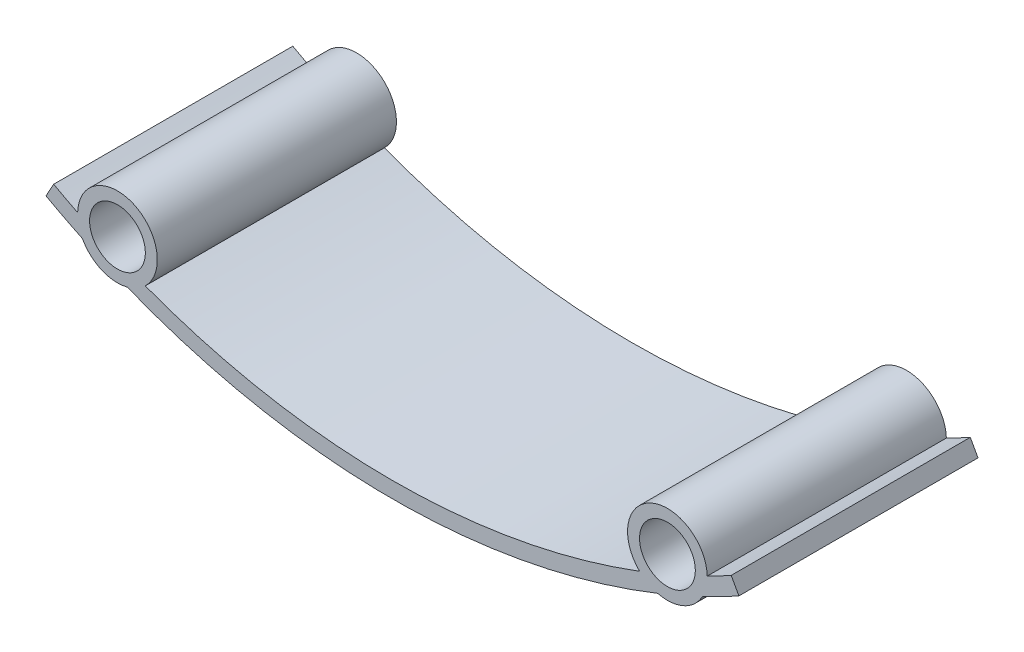
ISO-10303-21;
HEADER;
FILE_DESCRIPTION(('STEP AP214'),'2;1');
FILE_NAME('part.step','',(''),(''),'','','');
FILE_SCHEMA(('AUTOMOTIVE_DESIGN { 1 0 10303 214 1 1 1 1 }'));
ENDSEC;
DATA;
#1=APPLICATION_CONTEXT('core data for automotive mechanical design processes');
#2=APPLICATION_PROTOCOL_DEFINITION('international standard','automotive_design',2000,#1);
#3=PRODUCT_CONTEXT('',#1,'mechanical');
#4=PRODUCT('Part','Part','',(#3));
#5=PRODUCT_RELATED_PRODUCT_CATEGORY('part','',(#4));
#6=PRODUCT_DEFINITION_FORMATION('','',#4);
#7=PRODUCT_DEFINITION_CONTEXT('part definition',#1,'design');
#8=PRODUCT_DEFINITION('design','',#6,#7);
#9=PRODUCT_DEFINITION_SHAPE('','',#8);
#10=(LENGTH_UNIT() NAMED_UNIT(*) SI_UNIT(.MILLI.,.METRE.));
#11=(NAMED_UNIT(*) PLANE_ANGLE_UNIT() SI_UNIT($,.RADIAN.));
#12=(NAMED_UNIT(*) SI_UNIT($,.STERADIAN.) SOLID_ANGLE_UNIT());
#13=UNCERTAINTY_MEASURE_WITH_UNIT(LENGTH_MEASURE(1.E-05),#10,'distance_accuracy_value','');
#14=(GEOMETRIC_REPRESENTATION_CONTEXT(3) GLOBAL_UNCERTAINTY_ASSIGNED_CONTEXT((#13)) GLOBAL_UNIT_ASSIGNED_CONTEXT((#10,
#11,#12)) REPRESENTATION_CONTEXT('',''));
#15=CARTESIAN_POINT('',(0.,0.,0.));
#16=DIRECTION('',(0.,0.,1.));
#17=DIRECTION('',(1.,0.,0.));
#18=AXIS2_PLACEMENT_3D('',#15,#16,#17);
#19=CARTESIAN_POINT('',(34.5,11.2234171850543,30.));
#20=DIRECTION('',(0.,0.,-1.));
#21=DIRECTION('',(-1.,0.,0.));
#22=AXIS2_PLACEMENT_3D('',#19,#20,#21);
#23=CYLINDRICAL_SURFACE('',#22,5.);
#24=CARTESIAN_POINT('',(34.5,11.2234171850543,0.));
#25=DIRECTION('',(0.,0.,1.));
#26=DIRECTION('',(1.,0.,0.));
#27=AXIS2_PLACEMENT_3D('',#24,#25,#26);
#28=CIRCLE('',#27,5.);
#29=CARTESIAN_POINT('',(33.272867255611,6.37634123891438,0.));
#30=VERTEX_POINT('',#29);
#31=CARTESIAN_POINT('',(38.8944529174556,8.83830009017906,0.));
#32=VERTEX_POINT('',#31);
#33=EDGE_CURVE('E166',#30,#32,#28,.T.);
#34=ORIENTED_EDGE('',*,*,#33,.T.);
#35=DIRECTION('',(0.,0.,-1.));
#36=VECTOR('',#35,1.);
#37=CARTESIAN_POINT('',(38.8944529174556,8.83830009017906,30.));
#38=LINE('',#37,#36);
#39=CARTESIAN_POINT('',(38.8944529174556,8.83830009017906,30.));
#40=VERTEX_POINT('',#39);
#41=EDGE_CURVE('E11',#40,#32,#38,.T.);
#42=ORIENTED_EDGE('',*,*,#41,.F.);
#43=CARTESIAN_POINT('',(34.5,11.2234171850543,30.));
#44=DIRECTION('',(0.,0.,1.));
#45=DIRECTION('',(1.,0.,0.));
#46=AXIS2_PLACEMENT_3D('',#43,#44,#45);
#47=CIRCLE('',#46,5.);
#48=CARTESIAN_POINT('',(33.272867255611,6.37634123891438,30.));
#49=VERTEX_POINT('',#48);
#50=EDGE_CURVE('E433',#49,#40,#47,.T.);
#51=ORIENTED_EDGE('',*,*,#50,.F.);
#52=DIRECTION('',(0.,0.,-1.));
#53=VECTOR('',#52,1.);
#54=CARTESIAN_POINT('',(33.272867255611,6.37634123891438,30.));
#55=LINE('',#54,#53);
#56=EDGE_CURVE('E54',#49,#30,#55,.T.);
#57=ORIENTED_EDGE('',*,*,#56,.T.);
#58=EDGE_LOOP('',(#34,#42,#51,#57));
#59=FACE_BOUND('',#58,.T.);
#60=ADVANCED_FACE('F37',(#59),#23,.T.);
#61=CARTESIAN_POINT('',(0.,90.,30.));
#62=DIRECTION('',(0.,0.,-1.));
#63=DIRECTION('',(-1.,0.,0.));
#64=AXIS2_PLACEMENT_3D('',#61,#62,#63);
#65=CYLINDRICAL_SURFACE('',#64,90.);
#66=CARTESIAN_POINT('',(0.,90.,0.));
#67=DIRECTION('',(0.,0.,1.));
#68=DIRECTION('',(1.,0.,0.));
#69=AXIS2_PLACEMENT_3D('',#66,#67,#68);
#70=CIRCLE('',#69,90.);
#71=CARTESIAN_POINT('',(43.4659090909091,11.1919119195192,0.));
#72=VERTEX_POINT('',#71);
#73=EDGE_CURVE('E168',#32,#72,#70,.T.);
#74=ORIENTED_EDGE('',*,*,#73,.T.);
#75=DIRECTION('',(0.,0.,-1.));
#76=VECTOR('',#75,1.);
#77=CARTESIAN_POINT('',(43.4659090909091,11.1919119195192,30.));
#78=LINE('',#77,#76);
#79=CARTESIAN_POINT('',(43.4659090909091,11.1919119195192,30.));
#80=VERTEX_POINT('',#79);
#81=EDGE_CURVE('E46',#80,#72,#78,.T.);
#82=ORIENTED_EDGE('',*,*,#81,.F.);
#83=CARTESIAN_POINT('',(0.,90.,30.));
#84=DIRECTION('',(0.,0.,1.));
#85=DIRECTION('',(1.,0.,0.));
#86=AXIS2_PLACEMENT_3D('',#83,#84,#85);
#87=CIRCLE('',#86,90.);
#88=EDGE_CURVE('E105',#40,#80,#87,.T.);
#89=ORIENTED_EDGE('',*,*,#88,.F.);
#90=ORIENTED_EDGE('',*,*,#41,.T.);
#91=EDGE_LOOP('',(#74,#82,#89,#90));
#92=FACE_BOUND('',#91,.T.);
#93=ADVANCED_FACE('F219',(#92),#65,.T.);
#94=CARTESIAN_POINT('',(38.0607243570502,20.9920583677688,30.));
#95=DIRECTION('',(0.875645423116451,0.482954545454551,0.));
#96=DIRECTION('',(-0.482954545454551,0.875645423116451,0.));
#97=AXIS2_PLACEMENT_3D('',#94,#95,#96);
#98=PLANE('',#97);
#99=DIRECTION('',(0.482954545454551,-0.875645423116451,0.));
#100=VECTOR('',#99,1.);
#101=CARTESIAN_POINT('',(38.0607243570502,20.9920583677688,0.));
#102=LINE('',#101,#100);
#103=CARTESIAN_POINT('',(42.5,12.9432027657521,0.));
#104=VERTEX_POINT('',#103);
#105=EDGE_CURVE('E171',#104,#72,#102,.T.);
#106=ORIENTED_EDGE('',*,*,#105,.F.);
#107=DIRECTION('',(0.,0.,-1.));
#108=VECTOR('',#107,1.);
#109=CARTESIAN_POINT('',(42.5,12.9432027657521,30.));
#110=LINE('',#109,#108);
#111=CARTESIAN_POINT('',(42.5,12.9432027657521,30.));
#112=VERTEX_POINT('',#111);
#113=EDGE_CURVE('E212',#112,#104,#110,.T.);
#114=ORIENTED_EDGE('',*,*,#113,.F.);
#115=DIRECTION('',(0.482954545454551,-0.875645423116451,0.));
#116=VECTOR('',#115,1.);
#117=CARTESIAN_POINT('',(38.0607243570502,20.9920583677688,30.));
#118=LINE('',#117,#116);
#119=EDGE_CURVE('E218',#112,#80,#118,.T.);
#120=ORIENTED_EDGE('',*,*,#119,.T.);
#121=ORIENTED_EDGE('',*,*,#81,.T.);
#122=EDGE_LOOP('',(#106,#114,#120,#121));
#123=FACE_BOUND('',#122,.T.);
#124=ADVANCED_FACE('F216',(#123),#98,.T.);
#125=CARTESIAN_POINT('',(0.,90.,30.));
#126=DIRECTION('',(0.,0.,-1.));
#127=DIRECTION('',(-1.,0.,0.));
#128=AXIS2_PLACEMENT_3D('',#125,#126,#127);
#129=CYLINDRICAL_SURFACE('',#128,88.);
#130=CARTESIAN_POINT('',(0.,90.,0.));
#131=DIRECTION('',(0.,0.,1.));
#132=DIRECTION('',(1.,0.,0.));
#133=AXIS2_PLACEMENT_3D('',#130,#131,#132);
#134=CIRCLE('',#133,88.);
#135=CARTESIAN_POINT('',(39.4980733174448,11.362208803847,0.));
#136=VERTEX_POINT('',#135);
#137=EDGE_CURVE('E174',#104,#136,#134,.F.);
#138=ORIENTED_EDGE('',*,*,#137,.T.);
#139=DIRECTION('',(0.,0.,-1.));
#140=VECTOR('',#139,1.);
#141=CARTESIAN_POINT('',(39.4980733174448,11.362208803847,30.));
#142=LINE('',#141,#140);
#143=CARTESIAN_POINT('',(39.4980733174448,11.362208803847,30.));
#144=VERTEX_POINT('',#143);
#145=EDGE_CURVE('E209',#144,#136,#142,.T.);
#146=ORIENTED_EDGE('',*,*,#145,.F.);
#147=CARTESIAN_POINT('',(0.,90.,30.));
#148=DIRECTION('',(0.,0.,1.));
#149=DIRECTION('',(1.,0.,0.));
#150=AXIS2_PLACEMENT_3D('',#147,#148,#149);
#151=CIRCLE('',#150,88.);
#152=EDGE_CURVE('E237',#112,#144,#151,.F.);
#153=ORIENTED_EDGE('',*,*,#152,.F.);
#154=ORIENTED_EDGE('',*,*,#113,.T.);
#155=EDGE_LOOP('',(#138,#146,#153,#154));
#156=FACE_BOUND('',#155,.T.);
#157=ADVANCED_FACE('F228',(#156),#129,.F.);
#158=CARTESIAN_POINT('',(34.5,11.2234171850543,30.));
#159=DIRECTION('',(0.,0.,-1.));
#160=DIRECTION('',(-1.,0.,0.));
#161=AXIS2_PLACEMENT_3D('',#158,#159,#160);
#162=CYLINDRICAL_SURFACE('',#161,5.00000000000001);
#163=CARTESIAN_POINT('',(34.5,11.2234171850543,0.));
#164=DIRECTION('',(0.,0.,1.));
#165=DIRECTION('',(1.,0.,0.));
#166=AXIS2_PLACEMENT_3D('',#163,#164,#165);
#167=CIRCLE('',#166,5.00000000000001);
#168=CARTESIAN_POINT('',(31.0086194894779,7.64427453202316,0.));
#169=VERTEX_POINT('',#168);
#170=EDGE_CURVE('E176',#136,#169,#167,.T.);
#171=ORIENTED_EDGE('',*,*,#170,.T.);
#172=DIRECTION('',(0.,0.,-1.));
#173=VECTOR('',#172,1.);
#174=CARTESIAN_POINT('',(31.0086194894779,7.64427453202316,30.));
#175=LINE('',#174,#173);
#176=CARTESIAN_POINT('',(31.0086194894779,7.64427453202316,30.));
#177=VERTEX_POINT('',#176);
#178=EDGE_CURVE('E206',#177,#169,#175,.T.);
#179=ORIENTED_EDGE('',*,*,#178,.F.);
#180=CARTESIAN_POINT('',(34.5,11.2234171850543,30.));
#181=DIRECTION('',(0.,0.,1.));
#182=DIRECTION('',(1.,0.,0.));
#183=AXIS2_PLACEMENT_3D('',#180,#181,#182);
#184=CIRCLE('',#183,5.00000000000001);
#185=EDGE_CURVE('E234',#144,#177,#184,.T.);
#186=ORIENTED_EDGE('',*,*,#185,.F.);
#187=ORIENTED_EDGE('',*,*,#145,.T.);
#188=EDGE_LOOP('',(#171,#179,#186,#187));
#189=FACE_BOUND('',#188,.T.);
#190=ADVANCED_FACE('F232',(#189),#162,.T.);
#191=CARTESIAN_POINT('',(0.,90.,30.));
#192=DIRECTION('',(0.,0.,-1.));
#193=DIRECTION('',(-1.,0.,0.));
#194=AXIS2_PLACEMENT_3D('',#191,#192,#193);
#195=CYLINDRICAL_SURFACE('',#194,88.);
#196=CARTESIAN_POINT('',(0.,90.,0.));
#197=DIRECTION('',(0.,0.,1.));
#198=DIRECTION('',(1.,0.,0.));
#199=AXIS2_PLACEMENT_3D('',#196,#197,#198);
#200=CIRCLE('',#199,88.);
#201=CARTESIAN_POINT('',(-31.0086194894779,7.64427453202315,0.));
#202=VERTEX_POINT('',#201);
#203=EDGE_CURVE('E178',#169,#202,#200,.F.);
#204=ORIENTED_EDGE('',*,*,#203,.T.);
#205=DIRECTION('',(0.,0.,-1.));
#206=VECTOR('',#205,1.);
#207=CARTESIAN_POINT('',(-31.0086194894779,7.64427453202315,30.));
#208=LINE('',#207,#206);
#209=CARTESIAN_POINT('',(-31.0086194894779,7.64427453202315,30.));
#210=VERTEX_POINT('',#209);
#211=EDGE_CURVE('E203',#210,#202,#208,.T.);
#212=ORIENTED_EDGE('',*,*,#211,.F.);
#213=CARTESIAN_POINT('',(0.,90.,30.));
#214=DIRECTION('',(0.,0.,1.));
#215=DIRECTION('',(1.,0.,0.));
#216=AXIS2_PLACEMENT_3D('',#213,#214,#215);
#217=CIRCLE('',#216,88.);
#218=EDGE_CURVE('E236',#177,#210,#217,.F.);
#219=ORIENTED_EDGE('',*,*,#218,.F.);
#220=ORIENTED_EDGE('',*,*,#178,.T.);
#221=EDGE_LOOP('',(#204,#212,#219,#220));
#222=FACE_BOUND('',#221,.T.);
#223=ADVANCED_FACE('F357',(#222),#195,.F.);
#224=CARTESIAN_POINT('',(-34.5,11.2234171850543,30.));
#225=DIRECTION('',(0.,0.,-1.));
#226=DIRECTION('',(-1.,0.,0.));
#227=AXIS2_PLACEMENT_3D('',#224,#225,#226);
#228=CYLINDRICAL_SURFACE('',#227,5.00000000000001);
#229=CARTESIAN_POINT('',(-34.5,11.2234171850543,0.));
#230=DIRECTION('',(0.,0.,1.));
#231=DIRECTION('',(1.,0.,0.));
#232=AXIS2_PLACEMENT_3D('',#229,#230,#231);
#233=CIRCLE('',#232,5.00000000000001);
#234=CARTESIAN_POINT('',(-39.4980733174447,11.362208803847,0.));
#235=VERTEX_POINT('',#234);
#236=EDGE_CURVE('E180',#202,#235,#233,.T.);
#237=ORIENTED_EDGE('',*,*,#236,.T.);
#238=DIRECTION('',(0.,0.,-1.));
#239=VECTOR('',#238,1.);
#240=CARTESIAN_POINT('',(-39.4980733174447,11.362208803847,30.));
#241=LINE('',#240,#239);
#242=CARTESIAN_POINT('',(-39.4980733174447,11.362208803847,30.));
#243=VERTEX_POINT('',#242);
#244=EDGE_CURVE('E200',#243,#235,#241,.T.);
#245=ORIENTED_EDGE('',*,*,#244,.F.);
#246=CARTESIAN_POINT('',(-34.5,11.2234171850543,30.));
#247=DIRECTION('',(0.,0.,1.));
#248=DIRECTION('',(1.,0.,0.));
#249=AXIS2_PLACEMENT_3D('',#246,#247,#248);
#250=CIRCLE('',#249,5.00000000000001);
#251=EDGE_CURVE('E239',#210,#243,#250,.T.);
#252=ORIENTED_EDGE('',*,*,#251,.F.);
#253=ORIENTED_EDGE('',*,*,#211,.T.);
#254=EDGE_LOOP('',(#237,#245,#252,#253));
#255=FACE_BOUND('',#254,.T.);
#256=ADVANCED_FACE('F347',(#255),#228,.T.);
#257=CARTESIAN_POINT('',(0.,90.,30.));
#258=DIRECTION('',(0.,0.,-1.));
#259=DIRECTION('',(-1.,0.,0.));
#260=AXIS2_PLACEMENT_3D('',#257,#258,#259);
#261=CYLINDRICAL_SURFACE('',#260,88.);
#262=CARTESIAN_POINT('',(0.,90.,0.));
#263=DIRECTION('',(0.,0.,1.));
#264=DIRECTION('',(1.,0.,0.));
#265=AXIS2_PLACEMENT_3D('',#262,#263,#264);
#266=CIRCLE('',#265,88.);
#267=CARTESIAN_POINT('',(-42.5,12.9432027657521,0.));
#268=VERTEX_POINT('',#267);
#269=EDGE_CURVE('E182',#235,#268,#266,.F.);
#270=ORIENTED_EDGE('',*,*,#269,.T.);
#271=DIRECTION('',(0.,0.,-1.));
#272=VECTOR('',#271,1.);
#273=CARTESIAN_POINT('',(-42.5,12.9432027657521,30.));
#274=LINE('',#273,#272);
#275=CARTESIAN_POINT('',(-42.5,12.9432027657521,30.));
#276=VERTEX_POINT('',#275);
#277=EDGE_CURVE('E198',#276,#268,#274,.T.);
#278=ORIENTED_EDGE('',*,*,#277,.F.);
#279=CARTESIAN_POINT('',(0.,90.,30.));
#280=DIRECTION('',(0.,0.,1.));
#281=DIRECTION('',(1.,0.,0.));
#282=AXIS2_PLACEMENT_3D('',#279,#280,#281);
#283=CIRCLE('',#282,88.);
#284=EDGE_CURVE('E155',#243,#276,#283,.F.);
#285=ORIENTED_EDGE('',*,*,#284,.F.);
#286=ORIENTED_EDGE('',*,*,#244,.T.);
#287=EDGE_LOOP('',(#270,#278,#285,#286));
#288=FACE_BOUND('',#287,.T.);
#289=ADVANCED_FACE('F249',(#288),#261,.F.);
#290=CARTESIAN_POINT('',(-38.0607243570505,20.9920583677685,30.));
#291=DIRECTION('',(-0.875645423116455,0.482954545454544,0.));
#292=DIRECTION('',(-0.482954545454544,-0.875645423116455,0.));
#293=AXIS2_PLACEMENT_3D('',#290,#291,#292);
#294=PLANE('',#293);
#295=DIRECTION('',(0.482954545454544,0.875645423116455,0.));
#296=VECTOR('',#295,1.);
#297=CARTESIAN_POINT('',(-38.0607243570505,20.9920583677685,0.));
#298=LINE('',#297,#296);
#299=CARTESIAN_POINT('',(-43.4659090909091,11.1919119195191,0.));
#300=VERTEX_POINT('',#299);
#301=EDGE_CURVE('E185',#300,#268,#298,.T.);
#302=ORIENTED_EDGE('',*,*,#301,.F.);
#303=DIRECTION('',(0.,0.,-1.));
#304=VECTOR('',#303,1.);
#305=CARTESIAN_POINT('',(-43.4659090909091,11.1919119195191,30.));
#306=LINE('',#305,#304);
#307=CARTESIAN_POINT('',(-43.4659090909091,11.1919119195191,30.));
#308=VERTEX_POINT('',#307);
#309=EDGE_CURVE('E142',#308,#300,#306,.T.);
#310=ORIENTED_EDGE('',*,*,#309,.F.);
#311=DIRECTION('',(0.482954545454544,0.875645423116455,0.));
#312=VECTOR('',#311,1.);
#313=CARTESIAN_POINT('',(-38.0607243570505,20.9920583677685,30.));
#314=LINE('',#313,#312);
#315=EDGE_CURVE('E153',#308,#276,#314,.T.);
#316=ORIENTED_EDGE('',*,*,#315,.T.);
#317=ORIENTED_EDGE('',*,*,#277,.T.);
#318=EDGE_LOOP('',(#302,#310,#316,#317));
#319=FACE_BOUND('',#318,.T.);
#320=ADVANCED_FACE('F253',(#319),#294,.T.);
#321=CARTESIAN_POINT('',(0.,90.,30.));
#322=DIRECTION('',(0.,0.,-1.));
#323=DIRECTION('',(-1.,0.,0.));
#324=AXIS2_PLACEMENT_3D('',#321,#322,#323);
#325=CYLINDRICAL_SURFACE('',#324,90.);
#326=CARTESIAN_POINT('',(0.,90.,0.));
#327=DIRECTION('',(0.,0.,1.));
#328=DIRECTION('',(1.,0.,0.));
#329=AXIS2_PLACEMENT_3D('',#326,#327,#328);
#330=CIRCLE('',#329,90.);
#331=CARTESIAN_POINT('',(-38.8944529174556,8.83830009017904,0.));
#332=VERTEX_POINT('',#331);
#333=EDGE_CURVE('E139',#332,#300,#330,.F.);
#334=ORIENTED_EDGE('',*,*,#333,.F.);
#335=DIRECTION('',(0.,0.,-1.));
#336=VECTOR('',#335,1.);
#337=CARTESIAN_POINT('',(-38.8944529174556,8.83830009017904,30.));
#338=LINE('',#337,#336);
#339=CARTESIAN_POINT('',(-38.8944529174556,8.83830009017904,30.));
#340=VERTEX_POINT('',#339);
#341=EDGE_CURVE('E133',#340,#332,#338,.T.);
#342=ORIENTED_EDGE('',*,*,#341,.F.);
#343=CARTESIAN_POINT('',(0.,90.,30.));
#344=DIRECTION('',(0.,0.,1.));
#345=DIRECTION('',(1.,0.,0.));
#346=AXIS2_PLACEMENT_3D('',#343,#344,#345);
#347=CIRCLE('',#346,90.);
#348=EDGE_CURVE('E137',#340,#308,#347,.F.);
#349=ORIENTED_EDGE('',*,*,#348,.T.);
#350=ORIENTED_EDGE('',*,*,#309,.T.);
#351=EDGE_LOOP('',(#334,#342,#349,#350));
#352=FACE_BOUND('',#351,.T.);
#353=ADVANCED_FACE('F135',(#352),#325,.T.);
#354=CARTESIAN_POINT('',(-34.5,11.2234171850543,30.));
#355=DIRECTION('',(0.,0.,-1.));
#356=DIRECTION('',(-1.,0.,0.));
#357=AXIS2_PLACEMENT_3D('',#354,#355,#356);
#358=CYLINDRICAL_SURFACE('',#357,5.);
#359=CARTESIAN_POINT('',(-34.5,11.2234171850543,0.));
#360=DIRECTION('',(0.,0.,1.));
#361=DIRECTION('',(1.,0.,0.));
#362=AXIS2_PLACEMENT_3D('',#359,#360,#361);
#363=CIRCLE('',#362,5.);
#364=CARTESIAN_POINT('',(-33.2728672556109,6.37634123891437,0.));
#365=VERTEX_POINT('',#364);
#366=EDGE_CURVE('E189',#332,#365,#363,.T.);
#367=ORIENTED_EDGE('',*,*,#366,.T.);
#368=DIRECTION('',(0.,0.,-1.));
#369=VECTOR('',#368,1.);
#370=CARTESIAN_POINT('',(-33.2728672556109,6.37634123891437,30.));
#371=LINE('',#370,#369);
#372=CARTESIAN_POINT('',(-33.2728672556109,6.37634123891437,30.));
#373=VERTEX_POINT('',#372);
#374=EDGE_CURVE('E93',#373,#365,#371,.T.);
#375=ORIENTED_EDGE('',*,*,#374,.F.);
#376=CARTESIAN_POINT('',(-34.5,11.2234171850543,30.));
#377=DIRECTION('',(0.,0.,1.));
#378=DIRECTION('',(1.,0.,0.));
#379=AXIS2_PLACEMENT_3D('',#376,#377,#378);
#380=CIRCLE('',#379,5.);
#381=EDGE_CURVE('E144',#340,#373,#380,.T.);
#382=ORIENTED_EDGE('',*,*,#381,.F.);
#383=ORIENTED_EDGE('',*,*,#341,.T.);
#384=EDGE_LOOP('',(#367,#375,#382,#383));
#385=FACE_BOUND('',#384,.T.);
#386=ADVANCED_FACE('F145',(#385),#358,.T.);
#387=CARTESIAN_POINT('',(34.5,11.2234171850543,30.));
#388=DIRECTION('',(0.,0.,-1.));
#389=DIRECTION('',(-1.,0.,0.));
#390=AXIS2_PLACEMENT_3D('',#387,#388,#389);
#391=CYLINDRICAL_SURFACE('',#390,3.5);
#392=CARTESIAN_POINT('',(34.5,11.2234171850543,30.));
#393=DIRECTION('',(0.,0.,1.));
#394=DIRECTION('',(1.,0.,0.));
#395=AXIS2_PLACEMENT_3D('',#392,#393,#394);
#396=CIRCLE('',#395,3.5);
#397=CARTESIAN_POINT('',(38.,11.2234171850543,30.));
#398=VERTEX_POINT('',#397);
#399=EDGE_CURVE('E282',#398,#398,#396,.T.);
#400=ORIENTED_EDGE('',*,*,#399,.T.);
#401=EDGE_LOOP('',(#400));
#402=FACE_BOUND('',#401,.T.);
#403=CARTESIAN_POINT('',(34.5,11.2234171850543,0.));
#404=DIRECTION('',(0.,0.,1.));
#405=DIRECTION('',(1.,0.,0.));
#406=AXIS2_PLACEMENT_3D('',#403,#404,#405);
#407=CIRCLE('',#406,3.5);
#408=CARTESIAN_POINT('',(38.,11.2234171850543,0.));
#409=VERTEX_POINT('',#408);
#410=EDGE_CURVE('E163',#409,#409,#407,.T.);
#411=ORIENTED_EDGE('',*,*,#410,.F.);
#412=EDGE_LOOP('',(#411));
#413=FACE_BOUND('',#412,.T.);
#414=ADVANCED_FACE('F263',(#402,#413),#391,.F.);
#415=CARTESIAN_POINT('',(-34.5,11.2234171850543,30.));
#416=DIRECTION('',(0.,0.,-1.));
#417=DIRECTION('',(-1.,0.,0.));
#418=AXIS2_PLACEMENT_3D('',#415,#416,#417);
#419=CYLINDRICAL_SURFACE('',#418,3.5);
#420=CARTESIAN_POINT('',(-34.5,11.2234171850543,30.));
#421=DIRECTION('',(0.,0.,1.));
#422=DIRECTION('',(1.,0.,0.));
#423=AXIS2_PLACEMENT_3D('',#420,#421,#422);
#424=CIRCLE('',#423,3.5);
#425=CARTESIAN_POINT('',(-31.,11.2234171850543,30.));
#426=VERTEX_POINT('',#425);
#427=EDGE_CURVE('E194',#426,#426,#424,.T.);
#428=ORIENTED_EDGE('',*,*,#427,.T.);
#429=EDGE_LOOP('',(#428));
#430=FACE_BOUND('',#429,.T.);
#431=CARTESIAN_POINT('',(-34.5,11.2234171850543,0.));
#432=DIRECTION('',(0.,0.,1.));
#433=DIRECTION('',(1.,0.,0.));
#434=AXIS2_PLACEMENT_3D('',#431,#432,#433);
#435=CIRCLE('',#434,3.5);
#436=CARTESIAN_POINT('',(-31.,11.2234171850543,0.));
#437=VERTEX_POINT('',#436);
#438=EDGE_CURVE('E160',#437,#437,#435,.T.);
#439=ORIENTED_EDGE('',*,*,#438,.F.);
#440=EDGE_LOOP('',(#439));
#441=FACE_BOUND('',#440,.T.);
#442=ADVANCED_FACE('F39',(#430,#441),#419,.F.);
#443=CARTESIAN_POINT('',(0.,90.,30.));
#444=DIRECTION('',(0.,0.,-1.));
#445=DIRECTION('',(-1.,0.,0.));
#446=AXIS2_PLACEMENT_3D('',#443,#444,#445);
#447=CYLINDRICAL_SURFACE('',#446,90.);
#448=CARTESIAN_POINT('',(0.,90.,0.));
#449=DIRECTION('',(0.,0.,1.));
#450=DIRECTION('',(1.,0.,0.));
#451=AXIS2_PLACEMENT_3D('',#448,#449,#450);
#452=CIRCLE('',#451,90.);
#453=EDGE_CURVE('E191',#30,#365,#452,.F.);
#454=ORIENTED_EDGE('',*,*,#453,.F.);
#455=ORIENTED_EDGE('',*,*,#56,.F.);
#456=CARTESIAN_POINT('',(0.,90.,30.));
#457=DIRECTION('',(0.,0.,1.));
#458=DIRECTION('',(1.,0.,0.));
#459=AXIS2_PLACEMENT_3D('',#456,#457,#458);
#460=CIRCLE('',#459,90.);
#461=EDGE_CURVE('E148',#49,#373,#460,.F.);
#462=ORIENTED_EDGE('',*,*,#461,.T.);
#463=ORIENTED_EDGE('',*,*,#374,.T.);
#464=EDGE_LOOP('',(#454,#455,#462,#463));
#465=FACE_BOUND('',#464,.T.);
#466=ADVANCED_FACE('F254',(#465),#447,.T.);
#467=CARTESIAN_POINT('',(0.,0.,30.));
#468=DIRECTION('',(0.,0.,1.));
#469=DIRECTION('',(1.,0.,0.));
#470=AXIS2_PLACEMENT_3D('',#467,#468,#469);
#471=PLANE('',#470);
#472=ORIENTED_EDGE('',*,*,#427,.F.);
#473=EDGE_LOOP('',(#472));
#474=FACE_BOUND('',#473,.T.);
#475=ORIENTED_EDGE('',*,*,#399,.F.);
#476=EDGE_LOOP('',(#475));
#477=FACE_BOUND('',#476,.T.);
#478=ORIENTED_EDGE('',*,*,#50,.T.);
#479=ORIENTED_EDGE('',*,*,#88,.T.);
#480=ORIENTED_EDGE('',*,*,#119,.F.);
#481=ORIENTED_EDGE('',*,*,#152,.T.);
#482=ORIENTED_EDGE('',*,*,#185,.T.);
#483=ORIENTED_EDGE('',*,*,#218,.T.);
#484=ORIENTED_EDGE('',*,*,#251,.T.);
#485=ORIENTED_EDGE('',*,*,#284,.T.);
#486=ORIENTED_EDGE('',*,*,#315,.F.);
#487=ORIENTED_EDGE('',*,*,#348,.F.);
#488=ORIENTED_EDGE('',*,*,#381,.T.);
#489=ORIENTED_EDGE('',*,*,#461,.F.);
#490=EDGE_LOOP('',(#478,#479,#480,#481,#482,#483,#484,#485,#486,#487,#488,#489));
#491=FACE_BOUND('',#490,.T.);
#492=ADVANCED_FACE('F151',(#474,#477,#491),#471,.T.);
#493=CARTESIAN_POINT('',(0.,0.,0.));
#494=DIRECTION('',(0.,0.,1.));
#495=DIRECTION('',(1.,0.,0.));
#496=AXIS2_PLACEMENT_3D('',#493,#494,#495);
#497=PLANE('',#496);
#498=ORIENTED_EDGE('',*,*,#438,.T.);
#499=EDGE_LOOP('',(#498));
#500=FACE_BOUND('',#499,.T.);
#501=ORIENTED_EDGE('',*,*,#410,.T.);
#502=EDGE_LOOP('',(#501));
#503=FACE_BOUND('',#502,.T.);
#504=ORIENTED_EDGE('',*,*,#33,.F.);
#505=ORIENTED_EDGE('',*,*,#453,.T.);
#506=ORIENTED_EDGE('',*,*,#366,.F.);
#507=ORIENTED_EDGE('',*,*,#333,.T.);
#508=ORIENTED_EDGE('',*,*,#301,.T.);
#509=ORIENTED_EDGE('',*,*,#269,.F.);
#510=ORIENTED_EDGE('',*,*,#236,.F.);
#511=ORIENTED_EDGE('',*,*,#203,.F.);
#512=ORIENTED_EDGE('',*,*,#170,.F.);
#513=ORIENTED_EDGE('',*,*,#137,.F.);
#514=ORIENTED_EDGE('',*,*,#105,.T.);
#515=ORIENTED_EDGE('',*,*,#73,.F.);
#516=EDGE_LOOP('',(#504,#505,#506,#507,#508,#509,#510,#511,#512,#513,#514,#515));
#517=FACE_BOUND('',#516,.T.);
#518=ADVANCED_FACE('F223',(#500,#503,#517),#497,.F.);
#519=CLOSED_SHELL('',(#60,#93,#124,#157,#190,#223,#256,#289,#320,#353,#386,#414,#442,#466,#492,#518));
#520=MANIFOLD_SOLID_BREP('B2',#519);
#521=ADVANCED_BREP_SHAPE_REPRESENTATION('',(#18,#520),#14);
#522=SHAPE_DEFINITION_REPRESENTATION(#9,#521);
ENDSEC;
END-ISO-10303-21;
